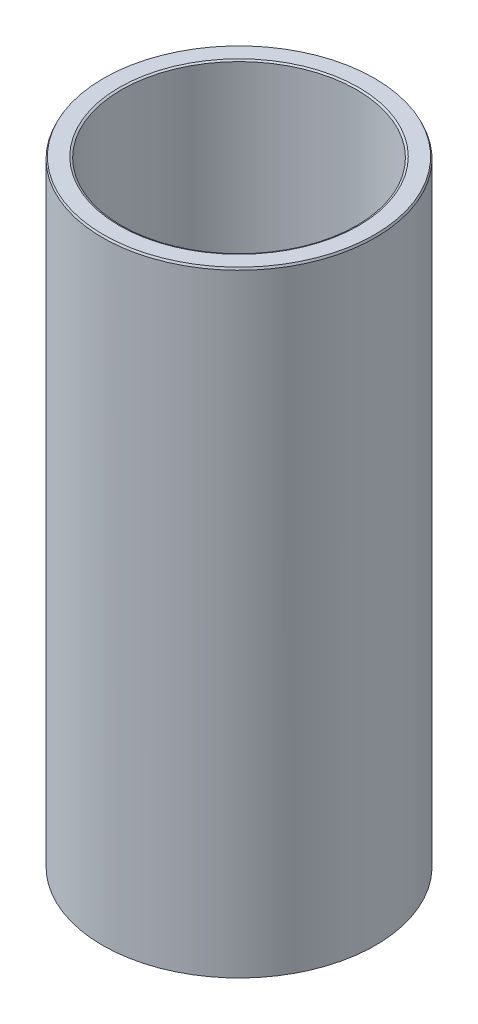
ISO-10303-21;
HEADER;
FILE_DESCRIPTION(('STEP AP214'),'2;1');
FILE_NAME('part.step','',(''),(''),'','','');
FILE_SCHEMA(('AUTOMOTIVE_DESIGN { 1 0 10303 214 1 1 1 1 }'));
ENDSEC;
DATA;
#1=APPLICATION_CONTEXT('core data for automotive mechanical design processes');
#2=APPLICATION_PROTOCOL_DEFINITION('international standard','automotive_design',2000,#1);
#3=PRODUCT_CONTEXT('',#1,'mechanical');
#4=PRODUCT('Part','Part','',(#3));
#5=PRODUCT_RELATED_PRODUCT_CATEGORY('part','',(#4));
#6=PRODUCT_DEFINITION_FORMATION('','',#4);
#7=PRODUCT_DEFINITION_CONTEXT('part definition',#1,'design');
#8=PRODUCT_DEFINITION('design','',#6,#7);
#9=PRODUCT_DEFINITION_SHAPE('','',#8);
#10=(LENGTH_UNIT() NAMED_UNIT(*) SI_UNIT(.MILLI.,.METRE.));
#11=(NAMED_UNIT(*) PLANE_ANGLE_UNIT() SI_UNIT($,.RADIAN.));
#12=(NAMED_UNIT(*) SI_UNIT($,.STERADIAN.) SOLID_ANGLE_UNIT());
#13=UNCERTAINTY_MEASURE_WITH_UNIT(LENGTH_MEASURE(1.E-05),#10,'distance_accuracy_value','');
#14=(GEOMETRIC_REPRESENTATION_CONTEXT(3) GLOBAL_UNCERTAINTY_ASSIGNED_CONTEXT((#13)) GLOBAL_UNIT_ASSIGNED_CONTEXT((#10,
#11,#12)) REPRESENTATION_CONTEXT('',''));
#15=CARTESIAN_POINT('',(0.,0.,0.));
#16=DIRECTION('',(0.,0.,1.));
#17=DIRECTION('',(1.,0.,0.));
#18=AXIS2_PLACEMENT_3D('',#15,#16,#17);
#19=CARTESIAN_POINT('',(0.,203.057956669543,0.));
#20=DIRECTION('',(0.,-1.,0.));
#21=DIRECTION('',(0.,0.,-1.));
#22=AXIS2_PLACEMENT_3D('',#19,#20,#21);
#23=CYLINDRICAL_SURFACE('',#22,45.);
#24=CARTESIAN_POINT('',(0.,0.323366757351312,0.));
#25=DIRECTION('',(0.,1.,0.));
#26=DIRECTION('',(0.,0.,1.));
#27=AXIS2_PLACEMENT_3D('',#24,#25,#26);
#28=CIRCLE('',#27,45.);
#29=CARTESIAN_POINT('',(0.,0.323366757351312,-45.));
#30=VERTEX_POINT('',#29);
#31=EDGE_CURVE('E10',#30,#30,#28,.T.);
#32=CARTESIAN_POINT('',(0.,202.395482409668,0.));
#33=DIRECTION('',(0.,1.,0.));
#34=DIRECTION('',(0.,0.,1.));
#35=AXIS2_PLACEMENT_3D('',#32,#33,#34);
#36=CIRCLE('',#35,45.);
#37=CARTESIAN_POINT('',(0.,202.395482409668,-45.));
#38=VERTEX_POINT('',#37);
#39=EDGE_CURVE('E50',#38,#38,#36,.F.);
#40=CARTESIAN_POINT('',(0.,0.323366757351312,-45.));
#41=CARTESIAN_POINT('',(0.,2.42828462872962,-45.));
#42=CARTESIAN_POINT('',(0.,4.53320250010792,-45.));
#43=CARTESIAN_POINT('',(0.,8.74303824286452,-45.));
#44=CARTESIAN_POINT('',(0.,10.8479561142428,-45.));
#45=CARTESIAN_POINT('',(0.,15.0577918569994,-45.));
#46=CARTESIAN_POINT('',(0.,17.1627097283777,-45.));
#47=CARTESIAN_POINT('',(0.,21.3725454711343,-45.));
#48=CARTESIAN_POINT('',(0.,23.4774633425126,-45.));
#49=CARTESIAN_POINT('',(0.,27.6872990852692,-45.));
#50=CARTESIAN_POINT('',(0.,29.7922169566475,-45.));
#51=CARTESIAN_POINT('',(0.,34.0020526994041,-45.));
#52=CARTESIAN_POINT('',(0.,36.1069705707824,-45.));
#53=CARTESIAN_POINT('',(0.,40.316806313539,-45.));
#54=CARTESIAN_POINT('',(0.,42.4217241849173,-45.));
#55=CARTESIAN_POINT('',(0.,46.6315599276739,-45.));
#56=CARTESIAN_POINT('',(0.,48.7364777990522,-45.));
#57=CARTESIAN_POINT('',(0.,52.9463135418088,-45.));
#58=CARTESIAN_POINT('',(0.,55.0512314131872,-45.));
#59=CARTESIAN_POINT('',(0.,59.2610671559437,-45.));
#60=CARTESIAN_POINT('',(0.,61.3659850273221,-45.));
#61=CARTESIAN_POINT('',(0.,65.5758207700787,-45.));
#62=CARTESIAN_POINT('',(0.,67.680738641457,-45.));
#63=CARTESIAN_POINT('',(0.,71.8905743842136,-45.));
#64=CARTESIAN_POINT('',(0.,73.9954922555919,-45.));
#65=CARTESIAN_POINT('',(0.,78.2053279983485,-45.));
#66=CARTESIAN_POINT('',(0.,80.3102458697268,-45.));
#67=CARTESIAN_POINT('',(0.,84.5200816124834,-45.));
#68=CARTESIAN_POINT('',(0.,86.6249994838617,-45.));
#69=CARTESIAN_POINT('',(0.,90.8348352266183,-45.));
#70=CARTESIAN_POINT('',(0.,92.9397530979966,-45.));
#71=CARTESIAN_POINT('',(0.,97.1495888407532,-45.));
#72=CARTESIAN_POINT('',(0.,99.2545067121315,-45.));
#73=CARTESIAN_POINT('',(0.,103.464342454888,-45.));
#74=CARTESIAN_POINT('',(0.,105.569260326266,-45.));
#75=CARTESIAN_POINT('',(0.,109.779096069023,-45.));
#76=CARTESIAN_POINT('',(0.,111.884013940401,-45.));
#77=CARTESIAN_POINT('',(0.,116.093849683158,-45.));
#78=CARTESIAN_POINT('',(0.,118.198767554536,-45.));
#79=CARTESIAN_POINT('',(0.,122.408603297293,-45.));
#80=CARTESIAN_POINT('',(0.,124.513521168671,-45.));
#81=CARTESIAN_POINT('',(0.,128.723356911428,-45.));
#82=CARTESIAN_POINT('',(0.,130.828274782806,-45.));
#83=CARTESIAN_POINT('',(0.,135.038110525563,-45.));
#84=CARTESIAN_POINT('',(0.,137.143028396941,-45.));
#85=CARTESIAN_POINT('',(0.,141.352864139697,-45.));
#86=CARTESIAN_POINT('',(0.,143.457782011076,-45.));
#87=CARTESIAN_POINT('',(0.,147.667617753832,-45.));
#88=CARTESIAN_POINT('',(0.,149.772535625211,-45.));
#89=CARTESIAN_POINT('',(0.,153.982371367967,-45.));
#90=CARTESIAN_POINT('',(0.,156.087289239346,-45.));
#91=CARTESIAN_POINT('',(0.,160.297124982102,-45.));
#92=CARTESIAN_POINT('',(0.,162.402042853481,-45.));
#93=CARTESIAN_POINT('',(0.,166.611878596237,-45.));
#94=CARTESIAN_POINT('',(0.,168.716796467615,-45.));
#95=CARTESIAN_POINT('',(0.,172.926632210372,-45.));
#96=CARTESIAN_POINT('',(0.,175.03155008175,-45.));
#97=CARTESIAN_POINT('',(0.,179.241385824507,-45.));
#98=CARTESIAN_POINT('',(0.,181.346303695885,-45.));
#99=CARTESIAN_POINT('',(0.,185.556139438642,-45.));
#100=CARTESIAN_POINT('',(0.,187.66105731002,-45.));
#101=CARTESIAN_POINT('',(0.,191.870893052777,-45.));
#102=CARTESIAN_POINT('',(0.,193.975810924155,-45.));
#103=CARTESIAN_POINT('',(0.,198.185646666912,-45.));
#104=CARTESIAN_POINT('',(0.,200.29056453829,-45.));
#105=CARTESIAN_POINT('',(0.,202.395482409668,-45.));
#106=B_SPLINE_CURVE_WITH_KNOTS('',3,(#40,#41,#42,#43,#44,#45,#46,#47,#48,#49,#50,#51,#52,#53,
#54,#55,#56,#57,#58,#59,#60,#61,#62,#63,#64,#65,#66,#67,#68,#69,#70,#71,#72,#73,#74,#75,#76,#77,
#78,#79,#80,#81,#82,#83,#84,#85,#86,#87,#88,#89,#90,#91,#92,#93,#94,#95,#96,#97,#98,#99,#100,
#101,#102,#103,#104,#105),.UNSPECIFIED.,.F.,.F.,(4,2,2,2,2,2,2,2,2,2,2,2,2,2,2,2,2,2,2,2,2,2,2,
2,2,2,2,2,2,2,2,2,4),(0.,6.31475361413492,12.6295072282698,18.9442608424047,25.2590144565396,
31.5737680706745,37.8885216848094,44.2032752989443,50.5180289130792,56.8327825272141,
63.1475361413491,69.462289755484,75.7770433696189,82.0917969837537,88.4065505978887,
94.7213042120236,101.036057826158,107.350811440293,113.665565054428,119.980318668563,
126.295072282698,132.609825896833,138.924579510968,145.239333125103,151.554086739238,
157.868840353373,164.183593967507,170.498347581642,176.813101195777,183.127854809912,
189.442608424047,195.757362038182,202.072115652317),.UNSPECIFIED.);
#107=EDGE_CURVE('BSEAM39',#30,#38,#106,.T.);
#108=ORIENTED_EDGE('',*,*,#31,.T.);
#109=ORIENTED_EDGE('',*,*,#39,.T.);
#110=ORIENTED_EDGE('',*,*,#107,.T.);
#111=ORIENTED_EDGE('',*,*,#107,.F.);
#112=EDGE_LOOP('',(#108,#110,#109,#111));
#113=FACE_BOUND('',#112,.T.);
#114=ADVANCED_FACE('F39',(#113),#23,.T.);
#115=CARTESIAN_POINT('',(0.,203.057956669543,0.));
#116=DIRECTION('',(0.,1.,0.));
#117=DIRECTION('',(0.,0.,1.));
#118=AXIS2_PLACEMENT_3D('',#115,#116,#117);
#119=PLANE('',#118);
#120=CARTESIAN_POINT('',(0.,203.057956669543,0.));
#121=DIRECTION('',(0.,1.,0.));
#122=DIRECTION('',(0.,0.,1.));
#123=AXIS2_PLACEMENT_3D('',#120,#121,#122);
#124=CIRCLE('',#123,39.4616221960325);
#125=CARTESIAN_POINT('',(0.,203.057956669543,39.4616221960325));
#126=VERTEX_POINT('',#125);
#127=EDGE_CURVE('E58',#126,#126,#124,.F.);
#128=ORIENTED_EDGE('',*,*,#127,.T.);
#129=EDGE_LOOP('',(#128));
#130=FACE_BOUND('',#129,.T.);
#131=CARTESIAN_POINT('',(0.,203.057956669543,0.));
#132=DIRECTION('',(0.,1.,0.));
#133=DIRECTION('',(0.,0.,1.));
#134=AXIS2_PLACEMENT_3D('',#131,#132,#133);
#135=CIRCLE('',#134,44.6766332426488);
#136=CARTESIAN_POINT('',(0.,203.057956669543,44.6766332426488));
#137=VERTEX_POINT('',#136);
#138=EDGE_CURVE('E61',#137,#137,#135,.T.);
#139=ORIENTED_EDGE('',*,*,#138,.T.);
#140=EDGE_LOOP('',(#139));
#141=FACE_BOUND('',#140,.T.);
#142=ADVANCED_FACE('F88',(#130,#141),#119,.T.);
#143=CARTESIAN_POINT('',(0.,0.,0.));
#144=DIRECTION('',(0.,1.,0.));
#145=DIRECTION('',(0.,0.,1.));
#146=AXIS2_PLACEMENT_3D('',#143,#144,#145);
#147=PLANE('',#146);
#148=CARTESIAN_POINT('',(0.,0.,0.));
#149=DIRECTION('',(0.,1.,0.));
#150=DIRECTION('',(0.,0.,1.));
#151=AXIS2_PLACEMENT_3D('',#148,#149,#150);
#152=CIRCLE('',#151,39.1225146935082);
#153=CARTESIAN_POINT('',(0.,0.,39.1225146935082));
#154=VERTEX_POINT('',#153);
#155=EDGE_CURVE('E51',#154,#154,#152,.T.);
#156=ORIENTED_EDGE('',*,*,#155,.T.);
#157=EDGE_LOOP('',(#156));
#158=FACE_BOUND('',#157,.T.);
#159=CARTESIAN_POINT('',(0.,0.,0.));
#160=DIRECTION('',(0.,1.,0.));
#161=DIRECTION('',(0.,0.,1.));
#162=AXIS2_PLACEMENT_3D('',#159,#160,#161);
#163=CIRCLE('',#162,44.3375257401245);
#164=CARTESIAN_POINT('',(0.,0.,44.3375257401245));
#165=VERTEX_POINT('',#164);
#166=EDGE_CURVE('E54',#165,#165,#163,.F.);
#167=ORIENTED_EDGE('',*,*,#166,.T.);
#168=EDGE_LOOP('',(#167));
#169=FACE_BOUND('',#168,.T.);
#170=ADVANCED_FACE('F83',(#158,#169),#147,.F.);
#171=CARTESIAN_POINT('',(0.,203.057956669543,0.));
#172=DIRECTION('',(0.,-1.,0.));
#173=DIRECTION('',(0.,0.,-1.));
#174=AXIS2_PLACEMENT_3D('',#171,#172,#173);
#175=CYLINDRICAL_SURFACE('',#174,38.799147936157);
#176=CARTESIAN_POINT('',(0.,202.734589912192,0.));
#177=DIRECTION('',(0.,1.,0.));
#178=DIRECTION('',(0.,0.,1.));
#179=AXIS2_PLACEMENT_3D('',#176,#177,#178);
#180=CIRCLE('',#179,38.799147936157);
#181=CARTESIAN_POINT('',(0.,202.734589912192,-38.799147936157));
#182=VERTEX_POINT('',#181);
#183=EDGE_CURVE('E67',#182,#182,#180,.T.);
#184=CARTESIAN_POINT('',(0.,0.662474259875284,0.));
#185=DIRECTION('',(0.,1.,0.));
#186=DIRECTION('',(0.,0.,1.));
#187=AXIS2_PLACEMENT_3D('',#184,#185,#186);
#188=CIRCLE('',#187,38.799147936157);
#189=CARTESIAN_POINT('',(0.,0.662474259875284,-38.799147936157));
#190=VERTEX_POINT('',#189);
#191=EDGE_CURVE('E69',#190,#190,#188,.F.);
#192=CARTESIAN_POINT('',(0.,202.734589912192,-38.799147936157));
#193=CARTESIAN_POINT('',(0.,200.629672040814,-38.799147936157));
#194=CARTESIAN_POINT('',(0.,198.524754169436,-38.799147936157));
#195=CARTESIAN_POINT('',(0.,194.314918426679,-38.799147936157));
#196=CARTESIAN_POINT('',(0.,192.210000555301,-38.799147936157));
#197=CARTESIAN_POINT('',(0.,188.000164812544,-38.799147936157));
#198=CARTESIAN_POINT('',(0.,185.895246941166,-38.799147936157));
#199=CARTESIAN_POINT('',(0.,181.685411198409,-38.799147936157));
#200=CARTESIAN_POINT('',(0.,179.580493327031,-38.799147936157));
#201=CARTESIAN_POINT('',(0.,175.370657584274,-38.799147936157));
#202=CARTESIAN_POINT('',(0.,173.265739712896,-38.799147936157));
#203=CARTESIAN_POINT('',(0.,169.055903970139,-38.799147936157));
#204=CARTESIAN_POINT('',(0.,166.950986098761,-38.799147936157));
#205=CARTESIAN_POINT('',(0.,162.741150356004,-38.799147936157));
#206=CARTESIAN_POINT('',(0.,160.636232484626,-38.799147936157));
#207=CARTESIAN_POINT('',(0.,156.42639674187,-38.799147936157));
#208=CARTESIAN_POINT('',(0.,154.321478870491,-38.799147936157));
#209=CARTESIAN_POINT('',(0.,150.111643127735,-38.799147936157));
#210=CARTESIAN_POINT('',(0.,148.006725256356,-38.799147936157));
#211=CARTESIAN_POINT('',(0.,143.7968895136,-38.799147936157));
#212=CARTESIAN_POINT('',(0.,141.691971642221,-38.799147936157));
#213=CARTESIAN_POINT('',(0.,137.482135899465,-38.799147936157));
#214=CARTESIAN_POINT('',(0.,135.377218028087,-38.799147936157));
#215=CARTESIAN_POINT('',(0.,131.16738228533,-38.799147936157));
#216=CARTESIAN_POINT('',(0.,129.062464413952,-38.799147936157));
#217=CARTESIAN_POINT('',(0.,124.852628671195,-38.799147936157));
#218=CARTESIAN_POINT('',(0.,122.747710799817,-38.799147936157));
#219=CARTESIAN_POINT('',(0.,118.53787505706,-38.799147936157));
#220=CARTESIAN_POINT('',(0.,116.432957185682,-38.799147936157));
#221=CARTESIAN_POINT('',(0.,112.223121442925,-38.799147936157));
#222=CARTESIAN_POINT('',(0.,110.118203571547,-38.799147936157));
#223=CARTESIAN_POINT('',(0.,105.90836782879,-38.799147936157));
#224=CARTESIAN_POINT('',(0.,103.803449957412,-38.799147936157));
#225=CARTESIAN_POINT('',(0.,99.5936142146554,-38.799147936157));
#226=CARTESIAN_POINT('',(0.,97.4886963432771,-38.799147936157));
#227=CARTESIAN_POINT('',(0.,93.2788606005205,-38.799147936157));
#228=CARTESIAN_POINT('',(0.,91.1739427291422,-38.799147936157));
#229=CARTESIAN_POINT('',(0.,86.9641069863856,-38.799147936157));
#230=CARTESIAN_POINT('',(0.,84.8591891150073,-38.799147936157));
#231=CARTESIAN_POINT('',(0.,80.6493533722507,-38.799147936157));
#232=CARTESIAN_POINT('',(0.,78.5444355008724,-38.799147936157));
#233=CARTESIAN_POINT('',(0.,74.3345997581158,-38.799147936157));
#234=CARTESIAN_POINT('',(0.,72.2296818867375,-38.799147936157));
#235=CARTESIAN_POINT('',(0.,68.0198461439809,-38.799147936157));
#236=CARTESIAN_POINT('',(0.,65.9149282726026,-38.799147936157));
#237=CARTESIAN_POINT('',(0.,61.705092529846,-38.799147936157));
#238=CARTESIAN_POINT('',(0.,59.6001746584677,-38.799147936157));
#239=CARTESIAN_POINT('',(0.,55.3903389157111,-38.799147936157));
#240=CARTESIAN_POINT('',(0.,53.2854210443328,-38.799147936157));
#241=CARTESIAN_POINT('',(0.,49.0755853015762,-38.799147936157));
#242=CARTESIAN_POINT('',(0.,46.9706674301979,-38.799147936157));
#243=CARTESIAN_POINT('',(0.,42.7608316874413,-38.799147936157));
#244=CARTESIAN_POINT('',(0.,40.655913816063,-38.799147936157));
#245=CARTESIAN_POINT('',(0.,36.4460780733064,-38.799147936157));
#246=CARTESIAN_POINT('',(0.,34.3411602019281,-38.799147936157));
#247=CARTESIAN_POINT('',(0.,30.1313244591715,-38.799147936157));
#248=CARTESIAN_POINT('',(0.,28.0264065877932,-38.799147936157));
#249=CARTESIAN_POINT('',(0.,23.8165708450366,-38.799147936157));
#250=CARTESIAN_POINT('',(0.,21.7116529736583,-38.799147936157));
#251=CARTESIAN_POINT('',(0.,17.5018172309017,-38.799147936157));
#252=CARTESIAN_POINT('',(0.,15.3968993595234,-38.799147936157));
#253=CARTESIAN_POINT('',(0.,11.1870636167668,-38.799147936157));
#254=CARTESIAN_POINT('',(0.,9.08214574538851,-38.799147936157));
#255=CARTESIAN_POINT('',(0.,4.87231000263189,-38.799147936157));
#256=CARTESIAN_POINT('',(0.,2.76739213125359,-38.799147936157));
#257=CARTESIAN_POINT('',(0.,0.662474259875284,-38.799147936157));
#258=B_SPLINE_CURVE_WITH_KNOTS('',3,(#192,#193,#194,#195,#196,#197,#198,#199,#200,#201,#202,
#203,#204,#205,#206,#207,#208,#209,#210,#211,#212,#213,#214,#215,#216,#217,#218,#219,#220,#221,
#222,#223,#224,#225,#226,#227,#228,#229,#230,#231,#232,#233,#234,#235,#236,#237,#238,#239,#240,
#241,#242,#243,#244,#245,#246,#247,#248,#249,#250,#251,#252,#253,#254,#255,#256,#257),
.UNSPECIFIED.,.F.,.F.,(4,2,2,2,2,2,2,2,2,2,2,2,2,2,2,2,2,2,2,2,2,2,2,2,2,2,2,2,2,2,2,2,4),(0.,
6.31475361413492,12.6295072282698,18.9442608424047,25.2590144565396,31.5737680706745,
37.8885216848094,44.2032752989443,50.5180289130792,56.8327825272141,63.147536141349,
69.4622897554839,75.7770433696188,82.0917969837537,88.4065505978886,94.7213042120235,
101.036057826158,107.350811440293,113.665565054428,119.980318668563,126.295072282698,
132.609825896833,138.924579510968,145.239333125103,151.554086739238,157.868840353373,
164.183593967507,170.498347581642,176.813101195777,183.127854809912,189.442608424047,
195.757362038182,202.072115652317),.UNSPECIFIED.);
#259=EDGE_CURVE('BSEAM71',#182,#190,#258,.T.);
#260=ORIENTED_EDGE('',*,*,#183,.T.);
#261=ORIENTED_EDGE('',*,*,#191,.T.);
#262=ORIENTED_EDGE('',*,*,#259,.T.);
#263=ORIENTED_EDGE('',*,*,#259,.F.);
#264=EDGE_LOOP('',(#260,#262,#261,#263));
#265=FACE_BOUND('',#264,.T.);
#266=ADVANCED_FACE('F71',(#265),#175,.F.);
#267=CARTESIAN_POINT('',(0.,202.734589912192,0.));
#268=DIRECTION('',(0.,1.,0.));
#269=DIRECTION('',(0.,0.,1.));
#270=AXIS2_PLACEMENT_3D('',#267,#268,#269);
#271=CONICAL_SURFACE('',#270,38.799147936157,1.11669802363774);
#272=ORIENTED_EDGE('',*,*,#127,.F.);
#273=EDGE_LOOP('',(#272));
#274=FACE_BOUND('',#273,.T.);
#275=ORIENTED_EDGE('',*,*,#183,.F.);
#276=EDGE_LOOP('',(#275));
#277=FACE_BOUND('',#276,.T.);
#278=ADVANCED_FACE('F77',(#274,#277),#271,.F.);
#279=CARTESIAN_POINT('',(0.,0.,0.));
#280=DIRECTION('',(0.,-1.,0.));
#281=DIRECTION('',(0.,0.,-1.));
#282=AXIS2_PLACEMENT_3D('',#279,#280,#281);
#283=CONICAL_SURFACE('',#282,39.1225146935082,0.454098303157172);
#284=ORIENTED_EDGE('',*,*,#191,.F.);
#285=EDGE_LOOP('',(#284));
#286=FACE_BOUND('',#285,.T.);
#287=ORIENTED_EDGE('',*,*,#155,.F.);
#288=EDGE_LOOP('',(#287));
#289=FACE_BOUND('',#288,.T.);
#290=ADVANCED_FACE('F73',(#286,#289),#283,.F.);
#291=CARTESIAN_POINT('',(0.,0.323366757351312,0.));
#292=DIRECTION('',(0.,1.,0.));
#293=DIRECTION('',(0.,0.,1.));
#294=AXIS2_PLACEMENT_3D('',#291,#292,#293);
#295=CONICAL_SURFACE('',#294,45.,1.11669802363771);
#296=ORIENTED_EDGE('',*,*,#166,.F.);
#297=EDGE_LOOP('',(#296));
#298=FACE_BOUND('',#297,.T.);
#299=ORIENTED_EDGE('',*,*,#31,.F.);
#300=EDGE_LOOP('',(#299));
#301=FACE_BOUND('',#300,.T.);
#302=ADVANCED_FACE('F76',(#298,#301),#295,.T.);
#303=CARTESIAN_POINT('',(0.,203.057956669543,0.));
#304=DIRECTION('',(0.,-1.,0.));
#305=DIRECTION('',(0.,0.,-1.));
#306=AXIS2_PLACEMENT_3D('',#303,#304,#305);
#307=CONICAL_SURFACE('',#306,44.6766332426488,0.454098303157179);
#308=ORIENTED_EDGE('',*,*,#39,.F.);
#309=EDGE_LOOP('',(#308));
#310=FACE_BOUND('',#309,.T.);
#311=ORIENTED_EDGE('',*,*,#138,.F.);
#312=EDGE_LOOP('',(#311));
#313=FACE_BOUND('',#312,.T.);
#314=ADVANCED_FACE('F45',(#310,#313),#307,.T.);
#315=CLOSED_SHELL('',(#114,#142,#170,#266,#278,#290,#302,#314));
#316=MANIFOLD_SOLID_BREP('B2',#315);
#317=ADVANCED_BREP_SHAPE_REPRESENTATION('',(#18,#316),#14);
#318=SHAPE_DEFINITION_REPRESENTATION(#9,#317);
ENDSEC;
END-ISO-10303-21;
